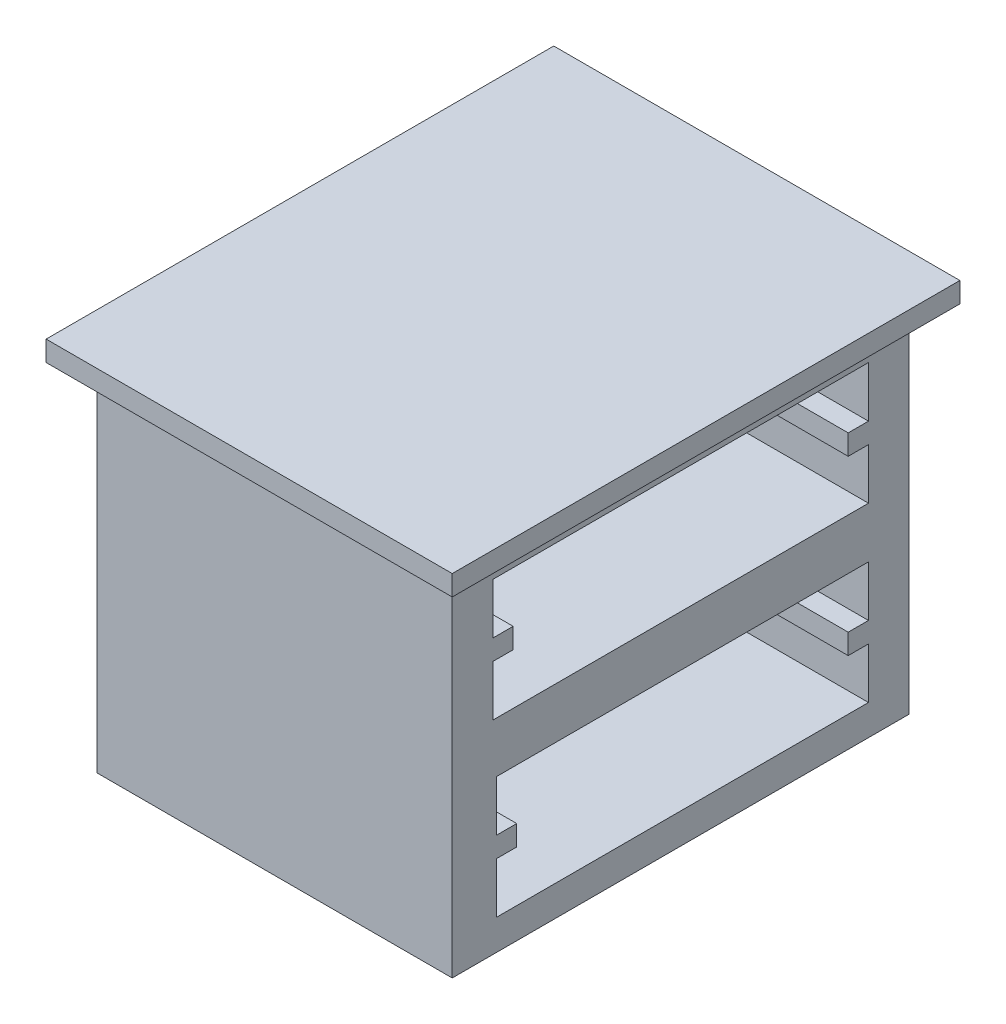
ISO-10303-21;
HEADER;
FILE_DESCRIPTION(('STEP AP214'),'2;1');
FILE_NAME('part.step','',(''),(''),'','','');
FILE_SCHEMA(('AUTOMOTIVE_DESIGN { 1 0 10303 214 1 1 1 1 }'));
ENDSEC;
DATA;
#1=APPLICATION_CONTEXT('core data for automotive mechanical design processes');
#2=APPLICATION_PROTOCOL_DEFINITION('international standard','automotive_design',2000,#1);
#3=PRODUCT_CONTEXT('',#1,'mechanical');
#4=PRODUCT('Part','Part','',(#3));
#5=PRODUCT_RELATED_PRODUCT_CATEGORY('part','',(#4));
#6=PRODUCT_DEFINITION_FORMATION('','',#4);
#7=PRODUCT_DEFINITION_CONTEXT('part definition',#1,'design');
#8=PRODUCT_DEFINITION('design','',#6,#7);
#9=PRODUCT_DEFINITION_SHAPE('','',#8);
#10=(LENGTH_UNIT() NAMED_UNIT(*) SI_UNIT(.MILLI.,.METRE.));
#11=(NAMED_UNIT(*) PLANE_ANGLE_UNIT() SI_UNIT($,.RADIAN.));
#12=(NAMED_UNIT(*) SI_UNIT($,.STERADIAN.) SOLID_ANGLE_UNIT());
#13=UNCERTAINTY_MEASURE_WITH_UNIT(LENGTH_MEASURE(1.E-05),#10,'distance_accuracy_value','');
#14=(GEOMETRIC_REPRESENTATION_CONTEXT(3) GLOBAL_UNCERTAINTY_ASSIGNED_CONTEXT((#13)) GLOBAL_UNIT_ASSIGNED_CONTEXT((#10,
#11,#12)) REPRESENTATION_CONTEXT('',''));
#15=CARTESIAN_POINT('',(0.,0.,0.));
#16=DIRECTION('',(0.,0.,1.));
#17=DIRECTION('',(1.,0.,0.));
#18=AXIS2_PLACEMENT_3D('',#15,#16,#17);
#19=CARTESIAN_POINT('',(0.,-20.,0.));
#20=DIRECTION('',(0.,1.,0.));
#21=DIRECTION('',(0.,0.,1.));
#22=AXIS2_PLACEMENT_3D('',#19,#20,#21);
#23=PLANE('',#22);
#24=DIRECTION('',(0.,0.,1.));
#25=VECTOR('',#24,1.);
#26=CARTESIAN_POINT('',(-200.,-20.,250.));
#27=LINE('',#26,#25);
#28=CARTESIAN_POINT('',(-200.,-20.,-250.));
#29=VERTEX_POINT('',#28);
#30=CARTESIAN_POINT('',(-200.,-20.,250.));
#31=VERTEX_POINT('',#30);
#32=EDGE_CURVE('E477',#29,#31,#27,.T.);
#33=ORIENTED_EDGE('',*,*,#32,.F.);
#34=DIRECTION('',(-1.,0.,0.));
#35=VECTOR('',#34,1.);
#36=CARTESIAN_POINT('',(200.,-20.,-250.));
#37=LINE('',#36,#35);
#38=CARTESIAN_POINT('',(200.,-20.,-250.));
#39=VERTEX_POINT('',#38);
#40=EDGE_CURVE('E487',#39,#29,#37,.T.);
#41=ORIENTED_EDGE('',*,*,#40,.F.);
#42=DIRECTION('',(0.,0.,-1.));
#43=VECTOR('',#42,1.);
#44=CARTESIAN_POINT('',(200.,-20.,250.));
#45=LINE('',#44,#43);
#46=CARTESIAN_POINT('',(200.,-20.,250.));
#47=VERTEX_POINT('',#46);
#48=EDGE_CURVE('E484',#47,#39,#45,.T.);
#49=ORIENTED_EDGE('',*,*,#48,.F.);
#50=DIRECTION('',(1.,0.,0.));
#51=VECTOR('',#50,1.);
#52=CARTESIAN_POINT('',(200.,-20.,250.));
#53=LINE('',#52,#51);
#54=EDGE_CURVE('E480',#31,#47,#53,.T.);
#55=ORIENTED_EDGE('',*,*,#54,.F.);
#56=EDGE_LOOP('',(#33,#41,#49,#55));
#57=FACE_BOUND('',#56,.T.);
#58=DIRECTION('',(0.,0.,-1.));
#59=VECTOR('',#58,1.);
#60=CARTESIAN_POINT('',(-175.,-20.,225.));
#61=LINE('',#60,#59);
#62=CARTESIAN_POINT('',(-175.,-20.,225.));
#63=VERTEX_POINT('',#62);
#64=CARTESIAN_POINT('',(-175.,-20.,-225.));
#65=VERTEX_POINT('',#64);
#66=EDGE_CURVE('E331',#63,#65,#61,.T.);
#67=ORIENTED_EDGE('',*,*,#66,.F.);
#68=DIRECTION('',(-1.,0.,0.));
#69=VECTOR('',#68,1.);
#70=CARTESIAN_POINT('',(175.,-20.,225.));
#71=LINE('',#70,#69);
#72=CARTESIAN_POINT('',(175.,-20.,225.));
#73=VERTEX_POINT('',#72);
#74=EDGE_CURVE('E448',#73,#63,#71,.T.);
#75=ORIENTED_EDGE('',*,*,#74,.F.);
#76=DIRECTION('',(0.,0.,1.));
#77=VECTOR('',#76,1.);
#78=CARTESIAN_POINT('',(175.,-20.,225.));
#79=LINE('',#78,#77);
#80=CARTESIAN_POINT('',(175.,-20.,-225.));
#81=VERTEX_POINT('',#80);
#82=EDGE_CURVE('E460',#81,#73,#79,.T.);
#83=ORIENTED_EDGE('',*,*,#82,.F.);
#84=DIRECTION('',(1.,0.,0.));
#85=VECTOR('',#84,1.);
#86=CARTESIAN_POINT('',(175.,-20.,-225.));
#87=LINE('',#86,#85);
#88=EDGE_CURVE('E457',#65,#81,#87,.T.);
#89=ORIENTED_EDGE('',*,*,#88,.F.);
#90=EDGE_LOOP('',(#67,#75,#83,#89));
#91=FACE_BOUND('',#90,.T.);
#92=ADVANCED_FACE('F37',(#57,#91),#23,.F.);
#93=CARTESIAN_POINT('',(-200.,-20.,250.));
#94=DIRECTION('',(-1.,0.,0.));
#95=DIRECTION('',(0.,0.,1.));
#96=AXIS2_PLACEMENT_3D('',#93,#94,#95);
#97=PLANE('',#96);
#98=DIRECTION('',(0.,0.,1.));
#99=VECTOR('',#98,1.);
#100=CARTESIAN_POINT('',(-200.,0.,250.));
#101=LINE('',#100,#99);
#102=CARTESIAN_POINT('',(-200.,0.,-250.));
#103=VERTEX_POINT('',#102);
#104=CARTESIAN_POINT('',(-200.,0.,250.));
#105=VERTEX_POINT('',#104);
#106=EDGE_CURVE('E476',#103,#105,#101,.T.);
#107=ORIENTED_EDGE('',*,*,#106,.F.);
#108=DIRECTION('',(0.,1.,0.));
#109=VECTOR('',#108,1.);
#110=CARTESIAN_POINT('',(-200.,-20.,-250.));
#111=LINE('',#110,#109);
#112=EDGE_CURVE('E11',#29,#103,#111,.T.);
#113=ORIENTED_EDGE('',*,*,#112,.F.);
#114=ORIENTED_EDGE('',*,*,#32,.T.);
#115=DIRECTION('',(0.,1.,0.));
#116=VECTOR('',#115,1.);
#117=CARTESIAN_POINT('',(-200.,-20.,250.));
#118=LINE('',#117,#116);
#119=EDGE_CURVE('E41',#31,#105,#118,.T.);
#120=ORIENTED_EDGE('',*,*,#119,.T.);
#121=EDGE_LOOP('',(#107,#113,#114,#120));
#122=FACE_BOUND('',#121,.T.);
#123=ADVANCED_FACE('F39',(#122),#97,.T.);
#124=CARTESIAN_POINT('',(200.,-20.,-250.));
#125=DIRECTION('',(0.,0.,-1.));
#126=DIRECTION('',(-1.,0.,0.));
#127=AXIS2_PLACEMENT_3D('',#124,#125,#126);
#128=PLANE('',#127);
#129=DIRECTION('',(-1.,0.,0.));
#130=VECTOR('',#129,1.);
#131=CARTESIAN_POINT('',(200.,0.,-250.));
#132=LINE('',#131,#130);
#133=CARTESIAN_POINT('',(200.,0.,-250.));
#134=VERTEX_POINT('',#133);
#135=EDGE_CURVE('E481',#134,#103,#132,.T.);
#136=ORIENTED_EDGE('',*,*,#135,.F.);
#137=DIRECTION('',(0.,1.,0.));
#138=VECTOR('',#137,1.);
#139=CARTESIAN_POINT('',(200.,-20.,-250.));
#140=LINE('',#139,#138);
#141=EDGE_CURVE('E46',#39,#134,#140,.T.);
#142=ORIENTED_EDGE('',*,*,#141,.F.);
#143=ORIENTED_EDGE('',*,*,#40,.T.);
#144=ORIENTED_EDGE('',*,*,#112,.T.);
#145=EDGE_LOOP('',(#136,#142,#143,#144));
#146=FACE_BOUND('',#145,.T.);
#147=ADVANCED_FACE('F513',(#146),#128,.T.);
#148=CARTESIAN_POINT('',(200.,-20.,250.));
#149=DIRECTION('',(1.,0.,0.));
#150=DIRECTION('',(0.,0.,-1.));
#151=AXIS2_PLACEMENT_3D('',#148,#149,#150);
#152=PLANE('',#151);
#153=DIRECTION('',(0.,0.,-1.));
#154=VECTOR('',#153,1.);
#155=CARTESIAN_POINT('',(200.,0.,250.));
#156=LINE('',#155,#154);
#157=CARTESIAN_POINT('',(200.,0.,250.));
#158=VERTEX_POINT('',#157);
#159=EDGE_CURVE('E495',#158,#134,#156,.T.);
#160=ORIENTED_EDGE('',*,*,#159,.F.);
#161=DIRECTION('',(0.,1.,0.));
#162=VECTOR('',#161,1.);
#163=CARTESIAN_POINT('',(200.,-20.,250.));
#164=LINE('',#163,#162);
#165=EDGE_CURVE('E500',#47,#158,#164,.T.);
#166=ORIENTED_EDGE('',*,*,#165,.F.);
#167=ORIENTED_EDGE('',*,*,#48,.T.);
#168=ORIENTED_EDGE('',*,*,#141,.T.);
#169=EDGE_LOOP('',(#160,#166,#167,#168));
#170=FACE_BOUND('',#169,.T.);
#171=ADVANCED_FACE('F519',(#170),#152,.T.);
#172=CARTESIAN_POINT('',(200.,-20.,250.));
#173=DIRECTION('',(0.,0.,1.));
#174=DIRECTION('',(1.,0.,0.));
#175=AXIS2_PLACEMENT_3D('',#172,#173,#174);
#176=PLANE('',#175);
#177=DIRECTION('',(1.,0.,0.));
#178=VECTOR('',#177,1.);
#179=CARTESIAN_POINT('',(200.,0.,250.));
#180=LINE('',#179,#178);
#181=EDGE_CURVE('E492',#105,#158,#180,.T.);
#182=ORIENTED_EDGE('',*,*,#181,.F.);
#183=ORIENTED_EDGE('',*,*,#119,.F.);
#184=ORIENTED_EDGE('',*,*,#54,.T.);
#185=ORIENTED_EDGE('',*,*,#165,.T.);
#186=EDGE_LOOP('',(#182,#183,#184,#185));
#187=FACE_BOUND('',#186,.T.);
#188=ADVANCED_FACE('F508',(#187),#176,.T.);
#189=CARTESIAN_POINT('',(0.,0.,0.));
#190=DIRECTION('',(0.,1.,0.));
#191=DIRECTION('',(0.,0.,1.));
#192=AXIS2_PLACEMENT_3D('',#189,#190,#191);
#193=PLANE('',#192);
#194=ORIENTED_EDGE('',*,*,#106,.T.);
#195=ORIENTED_EDGE('',*,*,#181,.T.);
#196=ORIENTED_EDGE('',*,*,#159,.T.);
#197=ORIENTED_EDGE('',*,*,#135,.T.);
#198=EDGE_LOOP('',(#194,#195,#196,#197));
#199=FACE_BOUND('',#198,.T.);
#200=ADVANCED_FACE('F510',(#199),#193,.T.);
#201=CARTESIAN_POINT('',(-175.,-370.,225.));
#202=DIRECTION('',(1.,0.,0.));
#203=DIRECTION('',(0.,0.,-1.));
#204=AXIS2_PLACEMENT_3D('',#201,#202,#203);
#205=PLANE('',#204);
#206=ORIENTED_EDGE('',*,*,#66,.T.);
#207=DIRECTION('',(0.,1.,0.));
#208=VECTOR('',#207,1.);
#209=CARTESIAN_POINT('',(-175.,-370.,-225.));
#210=LINE('',#209,#208);
#211=CARTESIAN_POINT('',(-175.,-370.,-225.));
#212=VERTEX_POINT('',#211);
#213=EDGE_CURVE('E473',#212,#65,#210,.T.);
#214=ORIENTED_EDGE('',*,*,#213,.F.);
#215=DIRECTION('',(0.,0.,-1.));
#216=VECTOR('',#215,1.);
#217=CARTESIAN_POINT('',(-175.,-370.,225.));
#218=LINE('',#217,#216);
#219=CARTESIAN_POINT('',(-175.,-370.,225.));
#220=VERTEX_POINT('',#219);
#221=EDGE_CURVE('E444',#220,#212,#218,.T.);
#222=ORIENTED_EDGE('',*,*,#221,.F.);
#223=DIRECTION('',(0.,1.,0.));
#224=VECTOR('',#223,1.);
#225=CARTESIAN_POINT('',(-175.,-370.,225.));
#226=LINE('',#225,#224);
#227=EDGE_CURVE('E454',#220,#63,#226,.T.);
#228=ORIENTED_EDGE('',*,*,#227,.T.);
#229=EDGE_LOOP('',(#206,#214,#222,#228));
#230=FACE_BOUND('',#229,.T.);
#231=ADVANCED_FACE('F534',(#230),#205,.F.);
#232=CARTESIAN_POINT('',(175.,-370.,-225.));
#233=DIRECTION('',(0.,0.,1.));
#234=DIRECTION('',(1.,0.,0.));
#235=AXIS2_PLACEMENT_3D('',#232,#233,#234);
#236=PLANE('',#235);
#237=ORIENTED_EDGE('',*,*,#88,.T.);
#238=DIRECTION('',(0.,1.,0.));
#239=VECTOR('',#238,1.);
#240=CARTESIAN_POINT('',(175.,-370.,-225.));
#241=LINE('',#240,#239);
#242=CARTESIAN_POINT('',(175.,-370.,-225.));
#243=VERTEX_POINT('',#242);
#244=EDGE_CURVE('E470',#243,#81,#241,.T.);
#245=ORIENTED_EDGE('',*,*,#244,.F.);
#246=DIRECTION('',(1.,0.,0.));
#247=VECTOR('',#246,1.);
#248=CARTESIAN_POINT('',(175.,-370.,-225.));
#249=LINE('',#248,#247);
#250=EDGE_CURVE('E447',#212,#243,#249,.T.);
#251=ORIENTED_EDGE('',*,*,#250,.F.);
#252=ORIENTED_EDGE('',*,*,#213,.T.);
#253=EDGE_LOOP('',(#237,#245,#251,#252));
#254=FACE_BOUND('',#253,.T.);
#255=ADVANCED_FACE('F540',(#254),#236,.F.);
#256=CARTESIAN_POINT('',(175.,-370.,225.));
#257=DIRECTION('',(-1.,0.,0.));
#258=DIRECTION('',(0.,0.,1.));
#259=AXIS2_PLACEMENT_3D('',#256,#257,#258);
#260=PLANE('',#259);
#261=DIRECTION('',(0.,0.,-1.));
#262=VECTOR('',#261,1.);
#263=CARTESIAN_POINT('',(175.,-100.,185.));
#264=LINE('',#263,#262);
#265=CARTESIAN_POINT('',(175.,-100.,185.));
#266=VERTEX_POINT('',#265);
#267=CARTESIAN_POINT('',(175.,-100.,165.));
#268=VERTEX_POINT('',#267);
#269=EDGE_CURVE('E300',#266,#268,#264,.T.);
#270=ORIENTED_EDGE('',*,*,#269,.F.);
#271=DIRECTION('',(0.,-1.,0.));
#272=VECTOR('',#271,1.);
#273=CARTESIAN_POINT('',(175.,-50.,185.));
#274=LINE('',#273,#272);
#275=CARTESIAN_POINT('',(175.,-50.,185.));
#276=VERTEX_POINT('',#275);
#277=EDGE_CURVE('E54',#276,#266,#274,.T.);
#278=ORIENTED_EDGE('',*,*,#277,.F.);
#279=DIRECTION('',(0.,0.,1.));
#280=VECTOR('',#279,1.);
#281=CARTESIAN_POINT('',(175.,-50.,185.));
#282=LINE('',#281,#280);
#283=CARTESIAN_POINT('',(175.,-50.,-185.));
#284=VERTEX_POINT('',#283);
#285=EDGE_CURVE('E268',#284,#276,#282,.T.);
#286=ORIENTED_EDGE('',*,*,#285,.F.);
#287=DIRECTION('',(0.,1.,0.));
#288=VECTOR('',#287,1.);
#289=CARTESIAN_POINT('',(175.,-50.,-185.));
#290=LINE('',#289,#288);
#291=CARTESIAN_POINT('',(175.,-100.,-185.));
#292=VERTEX_POINT('',#291);
#293=EDGE_CURVE('E271',#292,#284,#290,.T.);
#294=ORIENTED_EDGE('',*,*,#293,.F.);
#295=DIRECTION('',(0.,0.,-1.));
#296=VECTOR('',#295,1.);
#297=CARTESIAN_POINT('',(175.,-100.,-185.));
#298=LINE('',#297,#296);
#299=CARTESIAN_POINT('',(175.,-100.,-165.));
#300=VERTEX_POINT('',#299);
#301=EDGE_CURVE('E324',#300,#292,#298,.T.);
#302=ORIENTED_EDGE('',*,*,#301,.F.);
#303=DIRECTION('',(0.,1.,0.));
#304=VECTOR('',#303,1.);
#305=CARTESIAN_POINT('',(175.,-100.,-165.));
#306=LINE('',#305,#304);
#307=CARTESIAN_POINT('',(175.,-120.,-165.));
#308=VERTEX_POINT('',#307);
#309=EDGE_CURVE('E321',#308,#300,#306,.T.);
#310=ORIENTED_EDGE('',*,*,#309,.F.);
#311=DIRECTION('',(0.,0.,1.));
#312=VECTOR('',#311,1.);
#313=CARTESIAN_POINT('',(175.,-120.,-185.));
#314=LINE('',#313,#312);
#315=CARTESIAN_POINT('',(175.,-120.,-185.));
#316=VERTEX_POINT('',#315);
#317=EDGE_CURVE('E318',#316,#308,#314,.T.);
#318=ORIENTED_EDGE('',*,*,#317,.F.);
#319=DIRECTION('',(0.,1.,0.));
#320=VECTOR('',#319,1.);
#321=CARTESIAN_POINT('',(175.,-120.,-185.));
#322=LINE('',#321,#320);
#323=CARTESIAN_POINT('',(175.,-170.,-185.));
#324=VERTEX_POINT('',#323);
#325=EDGE_CURVE('E315',#324,#316,#322,.T.);
#326=ORIENTED_EDGE('',*,*,#325,.F.);
#327=DIRECTION('',(0.,0.,-1.));
#328=VECTOR('',#327,1.);
#329=CARTESIAN_POINT('',(175.,-170.,185.));
#330=LINE('',#329,#328);
#331=CARTESIAN_POINT('',(175.,-170.,185.));
#332=VERTEX_POINT('',#331);
#333=EDGE_CURVE('E312',#332,#324,#330,.T.);
#334=ORIENTED_EDGE('',*,*,#333,.F.);
#335=DIRECTION('',(0.,-1.,0.));
#336=VECTOR('',#335,1.);
#337=CARTESIAN_POINT('',(175.,-120.,185.));
#338=LINE('',#337,#336);
#339=CARTESIAN_POINT('',(175.,-120.,185.));
#340=VERTEX_POINT('',#339);
#341=EDGE_CURVE('E309',#340,#332,#338,.T.);
#342=ORIENTED_EDGE('',*,*,#341,.F.);
#343=DIRECTION('',(0.,0.,1.));
#344=VECTOR('',#343,1.);
#345=CARTESIAN_POINT('',(175.,-120.,185.));
#346=LINE('',#345,#344);
#347=CARTESIAN_POINT('',(175.,-120.,165.));
#348=VERTEX_POINT('',#347);
#349=EDGE_CURVE('E306',#348,#340,#346,.T.);
#350=ORIENTED_EDGE('',*,*,#349,.F.);
#351=DIRECTION('',(0.,-1.,0.));
#352=VECTOR('',#351,1.);
#353=CARTESIAN_POINT('',(175.,-100.,165.));
#354=LINE('',#353,#352);
#355=EDGE_CURVE('E303',#268,#348,#354,.T.);
#356=ORIENTED_EDGE('',*,*,#355,.F.);
#357=EDGE_LOOP('',(#270,#278,#286,#294,#302,#310,#318,#326,#334,#342,#350,#356));
#358=FACE_BOUND('',#357,.T.);
#359=DIRECTION('',(0.,0.,-1.));
#360=VECTOR('',#359,1.);
#361=CARTESIAN_POINT('',(175.,-270.,181.478873239436));
#362=LINE('',#361,#360);
#363=CARTESIAN_POINT('',(175.,-270.,181.478873239436));
#364=VERTEX_POINT('',#363);
#365=CARTESIAN_POINT('',(175.,-270.,161.478873239436));
#366=VERTEX_POINT('',#365);
#367=EDGE_CURVE('E390',#364,#366,#362,.T.);
#368=ORIENTED_EDGE('',*,*,#367,.F.);
#369=DIRECTION('',(0.,-1.,0.));
#370=VECTOR('',#369,1.);
#371=CARTESIAN_POINT('',(175.,-220.,181.478873239436));
#372=LINE('',#371,#370);
#373=CARTESIAN_POINT('',(175.,-220.,181.478873239436));
#374=VERTEX_POINT('',#373);
#375=EDGE_CURVE('E62',#374,#364,#372,.T.);
#376=ORIENTED_EDGE('',*,*,#375,.F.);
#377=DIRECTION('',(0.,0.,1.));
#378=VECTOR('',#377,1.);
#379=CARTESIAN_POINT('',(175.,-220.,181.478873239436));
#380=LINE('',#379,#378);
#381=CARTESIAN_POINT('',(175.,-220.,-185.));
#382=VERTEX_POINT('',#381);
#383=EDGE_CURVE('E355',#382,#374,#380,.T.);
#384=ORIENTED_EDGE('',*,*,#383,.F.);
#385=DIRECTION('',(0.,1.,0.));
#386=VECTOR('',#385,1.);
#387=CARTESIAN_POINT('',(175.,-220.,-185.));
#388=LINE('',#387,#386);
#389=CARTESIAN_POINT('',(175.,-270.,-185.));
#390=VERTEX_POINT('',#389);
#391=EDGE_CURVE('E417',#390,#382,#388,.T.);
#392=ORIENTED_EDGE('',*,*,#391,.F.);
#393=DIRECTION('',(0.,0.,-1.));
#394=VECTOR('',#393,1.);
#395=CARTESIAN_POINT('',(175.,-270.,-185.));
#396=LINE('',#395,#394);
#397=CARTESIAN_POINT('',(175.,-270.,-165.));
#398=VERTEX_POINT('',#397);
#399=EDGE_CURVE('E414',#398,#390,#396,.T.);
#400=ORIENTED_EDGE('',*,*,#399,.F.);
#401=DIRECTION('',(0.,1.,0.));
#402=VECTOR('',#401,1.);
#403=CARTESIAN_POINT('',(175.,-270.,-165.));
#404=LINE('',#403,#402);
#405=CARTESIAN_POINT('',(175.,-290.,-165.));
#406=VERTEX_POINT('',#405);
#407=EDGE_CURVE('E411',#406,#398,#404,.T.);
#408=ORIENTED_EDGE('',*,*,#407,.F.);
#409=DIRECTION('',(0.,0.,1.));
#410=VECTOR('',#409,1.);
#411=CARTESIAN_POINT('',(175.,-290.,-185.));
#412=LINE('',#411,#410);
#413=CARTESIAN_POINT('',(175.,-290.,-185.));
#414=VERTEX_POINT('',#413);
#415=EDGE_CURVE('E408',#414,#406,#412,.T.);
#416=ORIENTED_EDGE('',*,*,#415,.F.);
#417=DIRECTION('',(0.,1.,0.));
#418=VECTOR('',#417,1.);
#419=CARTESIAN_POINT('',(175.,-290.,-185.));
#420=LINE('',#419,#418);
#421=CARTESIAN_POINT('',(175.,-340.,-185.));
#422=VERTEX_POINT('',#421);
#423=EDGE_CURVE('E405',#422,#414,#420,.T.);
#424=ORIENTED_EDGE('',*,*,#423,.F.);
#425=DIRECTION('',(0.,0.,-1.));
#426=VECTOR('',#425,1.);
#427=CARTESIAN_POINT('',(175.,-340.,181.478873239436));
#428=LINE('',#427,#426);
#429=CARTESIAN_POINT('',(175.,-340.,181.478873239436));
#430=VERTEX_POINT('',#429);
#431=EDGE_CURVE('E402',#430,#422,#428,.T.);
#432=ORIENTED_EDGE('',*,*,#431,.F.);
#433=DIRECTION('',(0.,-1.,0.));
#434=VECTOR('',#433,1.);
#435=CARTESIAN_POINT('',(175.,-290.,181.478873239436));
#436=LINE('',#435,#434);
#437=CARTESIAN_POINT('',(175.,-290.,181.478873239436));
#438=VERTEX_POINT('',#437);
#439=EDGE_CURVE('E399',#438,#430,#436,.T.);
#440=ORIENTED_EDGE('',*,*,#439,.F.);
#441=DIRECTION('',(0.,0.,1.));
#442=VECTOR('',#441,1.);
#443=CARTESIAN_POINT('',(175.,-290.,181.478873239436));
#444=LINE('',#443,#442);
#445=CARTESIAN_POINT('',(175.,-290.,161.478873239436));
#446=VERTEX_POINT('',#445);
#447=EDGE_CURVE('E396',#446,#438,#444,.T.);
#448=ORIENTED_EDGE('',*,*,#447,.F.);
#449=DIRECTION('',(0.,-1.,0.));
#450=VECTOR('',#449,1.);
#451=CARTESIAN_POINT('',(175.,-270.,161.478873239436));
#452=LINE('',#451,#450);
#453=EDGE_CURVE('E393',#366,#446,#452,.T.);
#454=ORIENTED_EDGE('',*,*,#453,.F.);
#455=EDGE_LOOP('',(#368,#376,#384,#392,#400,#408,#416,#424,#432,#440,#448,#454));
#456=FACE_BOUND('',#455,.T.);
#457=ORIENTED_EDGE('',*,*,#82,.T.);
#458=DIRECTION('',(0.,1.,0.));
#459=VECTOR('',#458,1.);
#460=CARTESIAN_POINT('',(175.,-370.,225.));
#461=LINE('',#460,#459);
#462=CARTESIAN_POINT('',(175.,-370.,225.));
#463=VERTEX_POINT('',#462);
#464=EDGE_CURVE('E467',#463,#73,#461,.T.);
#465=ORIENTED_EDGE('',*,*,#464,.F.);
#466=DIRECTION('',(0.,0.,1.));
#467=VECTOR('',#466,1.);
#468=CARTESIAN_POINT('',(175.,-370.,225.));
#469=LINE('',#468,#467);
#470=EDGE_CURVE('E450',#243,#463,#469,.T.);
#471=ORIENTED_EDGE('',*,*,#470,.F.);
#472=ORIENTED_EDGE('',*,*,#244,.T.);
#473=EDGE_LOOP('',(#457,#465,#471,#472));
#474=FACE_BOUND('',#473,.T.);
#475=ADVANCED_FACE('F545',(#358,#456,#474),#260,.F.);
#476=CARTESIAN_POINT('',(175.,-370.,225.));
#477=DIRECTION('',(0.,0.,-1.));
#478=DIRECTION('',(-1.,0.,0.));
#479=AXIS2_PLACEMENT_3D('',#476,#477,#478);
#480=PLANE('',#479);
#481=ORIENTED_EDGE('',*,*,#74,.T.);
#482=ORIENTED_EDGE('',*,*,#227,.F.);
#483=DIRECTION('',(-1.,0.,0.));
#484=VECTOR('',#483,1.);
#485=CARTESIAN_POINT('',(175.,-370.,225.));
#486=LINE('',#485,#484);
#487=EDGE_CURVE('E452',#463,#220,#486,.T.);
#488=ORIENTED_EDGE('',*,*,#487,.F.);
#489=ORIENTED_EDGE('',*,*,#464,.T.);
#490=EDGE_LOOP('',(#481,#482,#488,#489));
#491=FACE_BOUND('',#490,.T.);
#492=ADVANCED_FACE('F551',(#491),#480,.F.);
#493=CARTESIAN_POINT('',(0.,-370.,0.));
#494=DIRECTION('',(0.,1.,0.));
#495=DIRECTION('',(0.,0.,1.));
#496=AXIS2_PLACEMENT_3D('',#493,#494,#495);
#497=PLANE('',#496);
#498=ORIENTED_EDGE('',*,*,#221,.T.);
#499=ORIENTED_EDGE('',*,*,#250,.T.);
#500=ORIENTED_EDGE('',*,*,#470,.T.);
#501=ORIENTED_EDGE('',*,*,#487,.T.);
#502=EDGE_LOOP('',(#498,#499,#500,#501));
#503=FACE_BOUND('',#502,.T.);
#504=ADVANCED_FACE('F558',(#503),#497,.F.);
#505=CARTESIAN_POINT('',(-145.,-220.,181.478873239436));
#506=DIRECTION('',(0.,0.,1.));
#507=DIRECTION('',(1.,0.,0.));
#508=AXIS2_PLACEMENT_3D('',#505,#506,#507);
#509=PLANE('',#508);
#510=ORIENTED_EDGE('',*,*,#375,.T.);
#511=DIRECTION('',(1.,0.,0.));
#512=VECTOR('',#511,1.);
#513=CARTESIAN_POINT('',(-145.,-270.,181.478873239436));
#514=LINE('',#513,#512);
#515=CARTESIAN_POINT('',(-145.,-270.,181.478873239436));
#516=VERTEX_POINT('',#515);
#517=EDGE_CURVE('E388',#516,#364,#514,.T.);
#518=ORIENTED_EDGE('',*,*,#517,.F.);
#519=DIRECTION('',(0.,-1.,0.));
#520=VECTOR('',#519,1.);
#521=CARTESIAN_POINT('',(-145.,-220.,181.478873239436));
#522=LINE('',#521,#520);
#523=CARTESIAN_POINT('',(-145.,-220.,181.478873239436));
#524=VERTEX_POINT('',#523);
#525=EDGE_CURVE('E351',#524,#516,#522,.T.);
#526=ORIENTED_EDGE('',*,*,#525,.F.);
#527=DIRECTION('',(1.,0.,0.));
#528=VECTOR('',#527,1.);
#529=CARTESIAN_POINT('',(-145.,-220.,181.478873239436));
#530=LINE('',#529,#528);
#531=EDGE_CURVE('E301',#524,#374,#530,.T.);
#532=ORIENTED_EDGE('',*,*,#531,.T.);
#533=EDGE_LOOP('',(#510,#518,#526,#532));
#534=FACE_BOUND('',#533,.T.);
#535=ADVANCED_FACE('F560',(#534),#509,.F.);
#536=CARTESIAN_POINT('',(-145.,-220.,181.478873239436));
#537=DIRECTION('',(0.,1.,0.));
#538=DIRECTION('',(0.,0.,1.));
#539=AXIS2_PLACEMENT_3D('',#536,#537,#538);
#540=PLANE('',#539);
#541=ORIENTED_EDGE('',*,*,#383,.T.);
#542=ORIENTED_EDGE('',*,*,#531,.F.);
#543=DIRECTION('',(0.,0.,1.));
#544=VECTOR('',#543,1.);
#545=CARTESIAN_POINT('',(-145.,-220.,181.478873239436));
#546=LINE('',#545,#544);
#547=CARTESIAN_POINT('',(-145.,-220.,-185.));
#548=VERTEX_POINT('',#547);
#549=EDGE_CURVE('E385',#548,#524,#546,.T.);
#550=ORIENTED_EDGE('',*,*,#549,.F.);
#551=DIRECTION('',(1.,0.,0.));
#552=VECTOR('',#551,1.);
#553=CARTESIAN_POINT('',(-145.,-220.,-185.));
#554=LINE('',#553,#552);
#555=EDGE_CURVE('E423',#548,#382,#554,.T.);
#556=ORIENTED_EDGE('',*,*,#555,.T.);
#557=EDGE_LOOP('',(#541,#542,#550,#556));
#558=FACE_BOUND('',#557,.T.);
#559=ADVANCED_FACE('F566',(#558),#540,.F.);
#560=CARTESIAN_POINT('',(-145.,-220.,-185.));
#561=DIRECTION('',(0.,0.,-1.));
#562=DIRECTION('',(0.,1.,0.));
#563=AXIS2_PLACEMENT_3D('',#560,#561,#562);
#564=PLANE('',#563);
#565=ORIENTED_EDGE('',*,*,#391,.T.);
#566=ORIENTED_EDGE('',*,*,#555,.F.);
#567=DIRECTION('',(0.,1.,0.));
#568=VECTOR('',#567,1.);
#569=CARTESIAN_POINT('',(-145.,-220.,-185.));
#570=LINE('',#569,#568);
#571=CARTESIAN_POINT('',(-145.,-270.,-185.));
#572=VERTEX_POINT('',#571);
#573=EDGE_CURVE('E382',#572,#548,#570,.T.);
#574=ORIENTED_EDGE('',*,*,#573,.F.);
#575=DIRECTION('',(1.,0.,0.));
#576=VECTOR('',#575,1.);
#577=CARTESIAN_POINT('',(-145.,-270.,-185.));
#578=LINE('',#577,#576);
#579=EDGE_CURVE('E425',#572,#390,#578,.T.);
#580=ORIENTED_EDGE('',*,*,#579,.T.);
#581=EDGE_LOOP('',(#565,#566,#574,#580));
#582=FACE_BOUND('',#581,.T.);
#583=ADVANCED_FACE('F595',(#582),#564,.F.);
#584=CARTESIAN_POINT('',(-145.,-270.,-185.));
#585=DIRECTION('',(0.,-1.,0.));
#586=DIRECTION('',(0.,0.,-1.));
#587=AXIS2_PLACEMENT_3D('',#584,#585,#586);
#588=PLANE('',#587);
#589=ORIENTED_EDGE('',*,*,#399,.T.);
#590=ORIENTED_EDGE('',*,*,#579,.F.);
#591=DIRECTION('',(0.,0.,-1.));
#592=VECTOR('',#591,1.);
#593=CARTESIAN_POINT('',(-145.,-270.,-185.));
#594=LINE('',#593,#592);
#595=CARTESIAN_POINT('',(-145.,-270.,-165.));
#596=VERTEX_POINT('',#595);
#597=EDGE_CURVE('E379',#596,#572,#594,.T.);
#598=ORIENTED_EDGE('',*,*,#597,.F.);
#599=DIRECTION('',(1.,0.,0.));
#600=VECTOR('',#599,1.);
#601=CARTESIAN_POINT('',(-145.,-270.,-165.));
#602=LINE('',#601,#600);
#603=EDGE_CURVE('E427',#596,#398,#602,.T.);
#604=ORIENTED_EDGE('',*,*,#603,.T.);
#605=EDGE_LOOP('',(#589,#590,#598,#604));
#606=FACE_BOUND('',#605,.T.);
#607=ADVANCED_FACE('F598',(#606),#588,.F.);
#608=CARTESIAN_POINT('',(-145.,-270.,-165.));
#609=DIRECTION('',(0.,0.,-1.));
#610=DIRECTION('',(-1.,0.,0.));
#611=AXIS2_PLACEMENT_3D('',#608,#609,#610);
#612=PLANE('',#611);
#613=ORIENTED_EDGE('',*,*,#407,.T.);
#614=ORIENTED_EDGE('',*,*,#603,.F.);
#615=DIRECTION('',(0.,1.,0.));
#616=VECTOR('',#615,1.);
#617=CARTESIAN_POINT('',(-145.,-270.,-165.));
#618=LINE('',#617,#616);
#619=CARTESIAN_POINT('',(-145.,-290.,-165.));
#620=VERTEX_POINT('',#619);
#621=EDGE_CURVE('E376',#620,#596,#618,.T.);
#622=ORIENTED_EDGE('',*,*,#621,.F.);
#623=DIRECTION('',(1.,0.,0.));
#624=VECTOR('',#623,1.);
#625=CARTESIAN_POINT('',(-145.,-290.,-165.));
#626=LINE('',#625,#624);
#627=EDGE_CURVE('E429',#620,#406,#626,.T.);
#628=ORIENTED_EDGE('',*,*,#627,.T.);
#629=EDGE_LOOP('',(#613,#614,#622,#628));
#630=FACE_BOUND('',#629,.T.);
#631=ADVANCED_FACE('F601',(#630),#612,.F.);
#632=CARTESIAN_POINT('',(-145.,-290.,-185.));
#633=DIRECTION('',(0.,1.,0.));
#634=DIRECTION('',(0.,0.,1.));
#635=AXIS2_PLACEMENT_3D('',#632,#633,#634);
#636=PLANE('',#635);
#637=ORIENTED_EDGE('',*,*,#415,.T.);
#638=ORIENTED_EDGE('',*,*,#627,.F.);
#639=DIRECTION('',(0.,0.,1.));
#640=VECTOR('',#639,1.);
#641=CARTESIAN_POINT('',(-145.,-290.,-185.));
#642=LINE('',#641,#640);
#643=CARTESIAN_POINT('',(-145.,-290.,-185.));
#644=VERTEX_POINT('',#643);
#645=EDGE_CURVE('E373',#644,#620,#642,.T.);
#646=ORIENTED_EDGE('',*,*,#645,.F.);
#647=DIRECTION('',(1.,0.,0.));
#648=VECTOR('',#647,1.);
#649=CARTESIAN_POINT('',(-145.,-290.,-185.));
#650=LINE('',#649,#648);
#651=EDGE_CURVE('E431',#644,#414,#650,.T.);
#652=ORIENTED_EDGE('',*,*,#651,.T.);
#653=EDGE_LOOP('',(#637,#638,#646,#652));
#654=FACE_BOUND('',#653,.T.);
#655=ADVANCED_FACE('F606',(#654),#636,.F.);
#656=CARTESIAN_POINT('',(-145.,-290.,-185.));
#657=DIRECTION('',(0.,0.,-1.));
#658=DIRECTION('',(-1.,0.,0.));
#659=AXIS2_PLACEMENT_3D('',#656,#657,#658);
#660=PLANE('',#659);
#661=ORIENTED_EDGE('',*,*,#423,.T.);
#662=ORIENTED_EDGE('',*,*,#651,.F.);
#663=DIRECTION('',(0.,1.,0.));
#664=VECTOR('',#663,1.);
#665=CARTESIAN_POINT('',(-145.,-290.,-185.));
#666=LINE('',#665,#664);
#667=CARTESIAN_POINT('',(-145.,-340.,-185.));
#668=VERTEX_POINT('',#667);
#669=EDGE_CURVE('E370',#668,#644,#666,.T.);
#670=ORIENTED_EDGE('',*,*,#669,.F.);
#671=DIRECTION('',(1.,0.,0.));
#672=VECTOR('',#671,1.);
#673=CARTESIAN_POINT('',(-145.,-340.,-185.));
#674=LINE('',#673,#672);
#675=EDGE_CURVE('E433',#668,#422,#674,.T.);
#676=ORIENTED_EDGE('',*,*,#675,.T.);
#677=EDGE_LOOP('',(#661,#662,#670,#676));
#678=FACE_BOUND('',#677,.T.);
#679=ADVANCED_FACE('F610',(#678),#660,.F.);
#680=CARTESIAN_POINT('',(-145.,-340.,181.478873239436));
#681=DIRECTION('',(0.,-1.,0.));
#682=DIRECTION('',(0.,0.,-1.));
#683=AXIS2_PLACEMENT_3D('',#680,#681,#682);
#684=PLANE('',#683);
#685=ORIENTED_EDGE('',*,*,#431,.T.);
#686=ORIENTED_EDGE('',*,*,#675,.F.);
#687=DIRECTION('',(0.,0.,-1.));
#688=VECTOR('',#687,1.);
#689=CARTESIAN_POINT('',(-145.,-340.,181.478873239436));
#690=LINE('',#689,#688);
#691=CARTESIAN_POINT('',(-145.,-340.,181.478873239436));
#692=VERTEX_POINT('',#691);
#693=EDGE_CURVE('E367',#692,#668,#690,.T.);
#694=ORIENTED_EDGE('',*,*,#693,.F.);
#695=DIRECTION('',(1.,0.,0.));
#696=VECTOR('',#695,1.);
#697=CARTESIAN_POINT('',(-145.,-340.,181.478873239436));
#698=LINE('',#697,#696);
#699=EDGE_CURVE('E435',#692,#430,#698,.T.);
#700=ORIENTED_EDGE('',*,*,#699,.T.);
#701=EDGE_LOOP('',(#685,#686,#694,#700));
#702=FACE_BOUND('',#701,.T.);
#703=ADVANCED_FACE('F613',(#702),#684,.F.);
#704=CARTESIAN_POINT('',(-145.,-290.,181.478873239436));
#705=DIRECTION('',(0.,0.,1.));
#706=DIRECTION('',(1.,0.,0.));
#707=AXIS2_PLACEMENT_3D('',#704,#705,#706);
#708=PLANE('',#707);
#709=ORIENTED_EDGE('',*,*,#439,.T.);
#710=ORIENTED_EDGE('',*,*,#699,.F.);
#711=DIRECTION('',(0.,-1.,0.));
#712=VECTOR('',#711,1.);
#713=CARTESIAN_POINT('',(-145.,-290.,181.478873239436));
#714=LINE('',#713,#712);
#715=CARTESIAN_POINT('',(-145.,-290.,181.478873239436));
#716=VERTEX_POINT('',#715);
#717=EDGE_CURVE('E364',#716,#692,#714,.T.);
#718=ORIENTED_EDGE('',*,*,#717,.F.);
#719=DIRECTION('',(1.,0.,0.));
#720=VECTOR('',#719,1.);
#721=CARTESIAN_POINT('',(-145.,-290.,181.478873239436));
#722=LINE('',#721,#720);
#723=EDGE_CURVE('E437',#716,#438,#722,.T.);
#724=ORIENTED_EDGE('',*,*,#723,.T.);
#725=EDGE_LOOP('',(#709,#710,#718,#724));
#726=FACE_BOUND('',#725,.T.);
#727=ADVANCED_FACE('F616',(#726),#708,.F.);
#728=CARTESIAN_POINT('',(-145.,-290.,181.478873239436));
#729=DIRECTION('',(0.,1.,0.));
#730=DIRECTION('',(0.,0.,1.));
#731=AXIS2_PLACEMENT_3D('',#728,#729,#730);
#732=PLANE('',#731);
#733=ORIENTED_EDGE('',*,*,#447,.T.);
#734=ORIENTED_EDGE('',*,*,#723,.F.);
#735=DIRECTION('',(0.,0.,1.));
#736=VECTOR('',#735,1.);
#737=CARTESIAN_POINT('',(-145.,-290.,181.478873239436));
#738=LINE('',#737,#736);
#739=CARTESIAN_POINT('',(-145.,-290.,161.478873239436));
#740=VERTEX_POINT('',#739);
#741=EDGE_CURVE('E361',#740,#716,#738,.T.);
#742=ORIENTED_EDGE('',*,*,#741,.F.);
#743=DIRECTION('',(1.,0.,0.));
#744=VECTOR('',#743,1.);
#745=CARTESIAN_POINT('',(-145.,-290.,161.478873239436));
#746=LINE('',#745,#744);
#747=EDGE_CURVE('E439',#740,#446,#746,.T.);
#748=ORIENTED_EDGE('',*,*,#747,.T.);
#749=EDGE_LOOP('',(#733,#734,#742,#748));
#750=FACE_BOUND('',#749,.T.);
#751=ADVANCED_FACE('F620',(#750),#732,.F.);
#752=CARTESIAN_POINT('',(-145.,-270.,161.478873239436));
#753=DIRECTION('',(0.,0.,1.));
#754=DIRECTION('',(1.,0.,0.));
#755=AXIS2_PLACEMENT_3D('',#752,#753,#754);
#756=PLANE('',#755);
#757=ORIENTED_EDGE('',*,*,#453,.T.);
#758=ORIENTED_EDGE('',*,*,#747,.F.);
#759=DIRECTION('',(0.,-1.,0.));
#760=VECTOR('',#759,1.);
#761=CARTESIAN_POINT('',(-145.,-270.,161.478873239436));
#762=LINE('',#761,#760);
#763=CARTESIAN_POINT('',(-145.,-270.,161.478873239436));
#764=VERTEX_POINT('',#763);
#765=EDGE_CURVE('E358',#764,#740,#762,.T.);
#766=ORIENTED_EDGE('',*,*,#765,.F.);
#767=DIRECTION('',(1.,0.,0.));
#768=VECTOR('',#767,1.);
#769=CARTESIAN_POINT('',(-145.,-270.,161.478873239436));
#770=LINE('',#769,#768);
#771=EDGE_CURVE('E441',#764,#366,#770,.T.);
#772=ORIENTED_EDGE('',*,*,#771,.T.);
#773=EDGE_LOOP('',(#757,#758,#766,#772));
#774=FACE_BOUND('',#773,.T.);
#775=ADVANCED_FACE('F622',(#774),#756,.F.);
#776=CARTESIAN_POINT('',(-145.,-270.,181.478873239436));
#777=DIRECTION('',(0.,-1.,0.));
#778=DIRECTION('',(0.,0.,-1.));
#779=AXIS2_PLACEMENT_3D('',#776,#777,#778);
#780=PLANE('',#779);
#781=ORIENTED_EDGE('',*,*,#367,.T.);
#782=ORIENTED_EDGE('',*,*,#771,.F.);
#783=DIRECTION('',(0.,0.,-1.));
#784=VECTOR('',#783,1.);
#785=CARTESIAN_POINT('',(-145.,-270.,181.478873239436));
#786=LINE('',#785,#784);
#787=EDGE_CURVE('E354',#516,#764,#786,.T.);
#788=ORIENTED_EDGE('',*,*,#787,.F.);
#789=ORIENTED_EDGE('',*,*,#517,.T.);
#790=EDGE_LOOP('',(#781,#782,#788,#789));
#791=FACE_BOUND('',#790,.T.);
#792=ADVANCED_FACE('F582',(#791),#780,.F.);
#793=CARTESIAN_POINT('',(-145.,0.,0.));
#794=DIRECTION('',(1.,0.,0.));
#795=DIRECTION('',(0.,0.,-1.));
#796=AXIS2_PLACEMENT_3D('',#793,#794,#795);
#797=PLANE('',#796);
#798=ORIENTED_EDGE('',*,*,#525,.T.);
#799=ORIENTED_EDGE('',*,*,#787,.T.);
#800=ORIENTED_EDGE('',*,*,#765,.T.);
#801=ORIENTED_EDGE('',*,*,#741,.T.);
#802=ORIENTED_EDGE('',*,*,#717,.T.);
#803=ORIENTED_EDGE('',*,*,#693,.T.);
#804=ORIENTED_EDGE('',*,*,#669,.T.);
#805=ORIENTED_EDGE('',*,*,#645,.T.);
#806=ORIENTED_EDGE('',*,*,#621,.T.);
#807=ORIENTED_EDGE('',*,*,#597,.T.);
#808=ORIENTED_EDGE('',*,*,#573,.T.);
#809=ORIENTED_EDGE('',*,*,#549,.T.);
#810=EDGE_LOOP('',(#798,#799,#800,#801,#802,#803,#804,#805,#806,#807,#808,#809));
#811=FACE_BOUND('',#810,.T.);
#812=ADVANCED_FACE('F588',(#811),#797,.T.);
#813=CARTESIAN_POINT('',(-145.,-50.,185.));
#814=DIRECTION('',(0.,0.,1.));
#815=DIRECTION('',(1.,0.,0.));
#816=AXIS2_PLACEMENT_3D('',#813,#814,#815);
#817=PLANE('',#816);
#818=ORIENTED_EDGE('',*,*,#277,.T.);
#819=DIRECTION('',(1.,0.,0.));
#820=VECTOR('',#819,1.);
#821=CARTESIAN_POINT('',(-145.,-100.,185.));
#822=LINE('',#821,#820);
#823=CARTESIAN_POINT('',(-145.,-100.,185.));
#824=VERTEX_POINT('',#823);
#825=EDGE_CURVE('E245',#824,#266,#822,.T.);
#826=ORIENTED_EDGE('',*,*,#825,.F.);
#827=DIRECTION('',(0.,-1.,0.));
#828=VECTOR('',#827,1.);
#829=CARTESIAN_POINT('',(-145.,-50.,185.));
#830=LINE('',#829,#828);
#831=CARTESIAN_POINT('',(-145.,-50.,185.));
#832=VERTEX_POINT('',#831);
#833=EDGE_CURVE('E249',#832,#824,#830,.T.);
#834=ORIENTED_EDGE('',*,*,#833,.F.);
#835=DIRECTION('',(1.,0.,0.));
#836=VECTOR('',#835,1.);
#837=CARTESIAN_POINT('',(-145.,-50.,185.));
#838=LINE('',#837,#836);
#839=EDGE_CURVE('E329',#832,#276,#838,.T.);
#840=ORIENTED_EDGE('',*,*,#839,.T.);
#841=EDGE_LOOP('',(#818,#826,#834,#840));
#842=FACE_BOUND('',#841,.T.);
#843=ADVANCED_FACE('F247',(#842),#817,.F.);
#844=CARTESIAN_POINT('',(-145.,-50.,185.));
#845=DIRECTION('',(0.,1.,0.));
#846=DIRECTION('',(0.,0.,1.));
#847=AXIS2_PLACEMENT_3D('',#844,#845,#846);
#848=PLANE('',#847);
#849=ORIENTED_EDGE('',*,*,#285,.T.);
#850=ORIENTED_EDGE('',*,*,#839,.F.);
#851=DIRECTION('',(0.,0.,1.));
#852=VECTOR('',#851,1.);
#853=CARTESIAN_POINT('',(-145.,-50.,185.));
#854=LINE('',#853,#852);
#855=CARTESIAN_POINT('',(-145.,-50.,-185.));
#856=VERTEX_POINT('',#855);
#857=EDGE_CURVE('E255',#856,#832,#854,.T.);
#858=ORIENTED_EDGE('',*,*,#857,.F.);
#859=DIRECTION('',(1.,0.,0.));
#860=VECTOR('',#859,1.);
#861=CARTESIAN_POINT('',(-145.,-50.,-185.));
#862=LINE('',#861,#860);
#863=EDGE_CURVE('E332',#856,#284,#862,.T.);
#864=ORIENTED_EDGE('',*,*,#863,.T.);
#865=EDGE_LOOP('',(#849,#850,#858,#864));
#866=FACE_BOUND('',#865,.T.);
#867=ADVANCED_FACE('F651',(#866),#848,.F.);
#868=CARTESIAN_POINT('',(-145.,-50.,-185.));
#869=DIRECTION('',(0.,0.,-1.));
#870=DIRECTION('',(0.,1.,0.));
#871=AXIS2_PLACEMENT_3D('',#868,#869,#870);
#872=PLANE('',#871);
#873=ORIENTED_EDGE('',*,*,#293,.T.);
#874=ORIENTED_EDGE('',*,*,#863,.F.);
#875=DIRECTION('',(0.,1.,0.));
#876=VECTOR('',#875,1.);
#877=CARTESIAN_POINT('',(-145.,-50.,-185.));
#878=LINE('',#877,#876);
#879=CARTESIAN_POINT('',(-145.,-100.,-185.));
#880=VERTEX_POINT('',#879);
#881=EDGE_CURVE('E296',#880,#856,#878,.T.);
#882=ORIENTED_EDGE('',*,*,#881,.F.);
#883=DIRECTION('',(1.,0.,0.));
#884=VECTOR('',#883,1.);
#885=CARTESIAN_POINT('',(-145.,-100.,-185.));
#886=LINE('',#885,#884);
#887=EDGE_CURVE('E334',#880,#292,#886,.T.);
#888=ORIENTED_EDGE('',*,*,#887,.T.);
#889=EDGE_LOOP('',(#873,#874,#882,#888));
#890=FACE_BOUND('',#889,.T.);
#891=ADVANCED_FACE('F685',(#890),#872,.F.);
#892=CARTESIAN_POINT('',(-145.,-100.,-185.));
#893=DIRECTION('',(0.,-1.,0.));
#894=DIRECTION('',(0.,0.,-1.));
#895=AXIS2_PLACEMENT_3D('',#892,#893,#894);
#896=PLANE('',#895);
#897=ORIENTED_EDGE('',*,*,#301,.T.);
#898=ORIENTED_EDGE('',*,*,#887,.F.);
#899=DIRECTION('',(0.,0.,-1.));
#900=VECTOR('',#899,1.);
#901=CARTESIAN_POINT('',(-145.,-100.,-185.));
#902=LINE('',#901,#900);
#903=CARTESIAN_POINT('',(-145.,-100.,-165.));
#904=VERTEX_POINT('',#903);
#905=EDGE_CURVE('E293',#904,#880,#902,.T.);
#906=ORIENTED_EDGE('',*,*,#905,.F.);
#907=DIRECTION('',(1.,0.,0.));
#908=VECTOR('',#907,1.);
#909=CARTESIAN_POINT('',(-145.,-100.,-165.));
#910=LINE('',#909,#908);
#911=EDGE_CURVE('E336',#904,#300,#910,.T.);
#912=ORIENTED_EDGE('',*,*,#911,.T.);
#913=EDGE_LOOP('',(#897,#898,#906,#912));
#914=FACE_BOUND('',#913,.T.);
#915=ADVANCED_FACE('F681',(#914),#896,.F.);
#916=CARTESIAN_POINT('',(-145.,-100.,-165.));
#917=DIRECTION('',(0.,0.,-1.));
#918=DIRECTION('',(-1.,0.,0.));
#919=AXIS2_PLACEMENT_3D('',#916,#917,#918);
#920=PLANE('',#919);
#921=ORIENTED_EDGE('',*,*,#309,.T.);
#922=ORIENTED_EDGE('',*,*,#911,.F.);
#923=DIRECTION('',(0.,1.,0.));
#924=VECTOR('',#923,1.);
#925=CARTESIAN_POINT('',(-145.,-100.,-165.));
#926=LINE('',#925,#924);
#927=CARTESIAN_POINT('',(-145.,-120.,-165.));
#928=VERTEX_POINT('',#927);
#929=EDGE_CURVE('E290',#928,#904,#926,.T.);
#930=ORIENTED_EDGE('',*,*,#929,.F.);
#931=DIRECTION('',(1.,0.,0.));
#932=VECTOR('',#931,1.);
#933=CARTESIAN_POINT('',(-145.,-120.,-165.));
#934=LINE('',#933,#932);
#935=EDGE_CURVE('E338',#928,#308,#934,.T.);
#936=ORIENTED_EDGE('',*,*,#935,.T.);
#937=EDGE_LOOP('',(#921,#922,#930,#936));
#938=FACE_BOUND('',#937,.T.);
#939=ADVANCED_FACE('F677',(#938),#920,.F.);
#940=CARTESIAN_POINT('',(-145.,-120.,-185.));
#941=DIRECTION('',(0.,1.,0.));
#942=DIRECTION('',(0.,0.,1.));
#943=AXIS2_PLACEMENT_3D('',#940,#941,#942);
#944=PLANE('',#943);
#945=ORIENTED_EDGE('',*,*,#317,.T.);
#946=ORIENTED_EDGE('',*,*,#935,.F.);
#947=DIRECTION('',(0.,0.,1.));
#948=VECTOR('',#947,1.);
#949=CARTESIAN_POINT('',(-145.,-120.,-185.));
#950=LINE('',#949,#948);
#951=CARTESIAN_POINT('',(-145.,-120.,-185.));
#952=VERTEX_POINT('',#951);
#953=EDGE_CURVE('E287',#952,#928,#950,.T.);
#954=ORIENTED_EDGE('',*,*,#953,.F.);
#955=DIRECTION('',(1.,0.,0.));
#956=VECTOR('',#955,1.);
#957=CARTESIAN_POINT('',(-145.,-120.,-185.));
#958=LINE('',#957,#956);
#959=EDGE_CURVE('E340',#952,#316,#958,.T.);
#960=ORIENTED_EDGE('',*,*,#959,.T.);
#961=EDGE_LOOP('',(#945,#946,#954,#960));
#962=FACE_BOUND('',#961,.T.);
#963=ADVANCED_FACE('F673',(#962),#944,.F.);
#964=CARTESIAN_POINT('',(-145.,-120.,-185.));
#965=DIRECTION('',(0.,0.,-1.));
#966=DIRECTION('',(-1.,0.,0.));
#967=AXIS2_PLACEMENT_3D('',#964,#965,#966);
#968=PLANE('',#967);
#969=ORIENTED_EDGE('',*,*,#325,.T.);
#970=ORIENTED_EDGE('',*,*,#959,.F.);
#971=DIRECTION('',(0.,1.,0.));
#972=VECTOR('',#971,1.);
#973=CARTESIAN_POINT('',(-145.,-120.,-185.));
#974=LINE('',#973,#972);
#975=CARTESIAN_POINT('',(-145.,-170.,-185.));
#976=VERTEX_POINT('',#975);
#977=EDGE_CURVE('E284',#976,#952,#974,.T.);
#978=ORIENTED_EDGE('',*,*,#977,.F.);
#979=DIRECTION('',(1.,0.,0.));
#980=VECTOR('',#979,1.);
#981=CARTESIAN_POINT('',(-145.,-170.,-185.));
#982=LINE('',#981,#980);
#983=EDGE_CURVE('E342',#976,#324,#982,.T.);
#984=ORIENTED_EDGE('',*,*,#983,.T.);
#985=EDGE_LOOP('',(#969,#970,#978,#984));
#986=FACE_BOUND('',#985,.T.);
#987=ADVANCED_FACE('F669',(#986),#968,.F.);
#988=CARTESIAN_POINT('',(-145.,-170.,185.));
#989=DIRECTION('',(0.,-1.,0.));
#990=DIRECTION('',(0.,0.,-1.));
#991=AXIS2_PLACEMENT_3D('',#988,#989,#990);
#992=PLANE('',#991);
#993=ORIENTED_EDGE('',*,*,#333,.T.);
#994=ORIENTED_EDGE('',*,*,#983,.F.);
#995=DIRECTION('',(0.,0.,-1.));
#996=VECTOR('',#995,1.);
#997=CARTESIAN_POINT('',(-145.,-170.,185.));
#998=LINE('',#997,#996);
#999=CARTESIAN_POINT('',(-145.,-170.,185.));
#1000=VERTEX_POINT('',#999);
#1001=EDGE_CURVE('E281',#1000,#976,#998,.T.);
#1002=ORIENTED_EDGE('',*,*,#1001,.F.);
#1003=DIRECTION('',(1.,0.,0.));
#1004=VECTOR('',#1003,1.);
#1005=CARTESIAN_POINT('',(-145.,-170.,185.));
#1006=LINE('',#1005,#1004);
#1007=EDGE_CURVE('E344',#1000,#332,#1006,.T.);
#1008=ORIENTED_EDGE('',*,*,#1007,.T.);
#1009=EDGE_LOOP('',(#993,#994,#1002,#1008));
#1010=FACE_BOUND('',#1009,.T.);
#1011=ADVANCED_FACE('F665',(#1010),#992,.F.);
#1012=CARTESIAN_POINT('',(-145.,-120.,185.));
#1013=DIRECTION('',(0.,0.,1.));
#1014=DIRECTION('',(0.,-1.,0.));
#1015=AXIS2_PLACEMENT_3D('',#1012,#1013,#1014);
#1016=PLANE('',#1015);
#1017=ORIENTED_EDGE('',*,*,#341,.T.);
#1018=ORIENTED_EDGE('',*,*,#1007,.F.);
#1019=DIRECTION('',(0.,-1.,0.));
#1020=VECTOR('',#1019,1.);
#1021=CARTESIAN_POINT('',(-145.,-120.,185.));
#1022=LINE('',#1021,#1020);
#1023=CARTESIAN_POINT('',(-145.,-120.,185.));
#1024=VERTEX_POINT('',#1023);
#1025=EDGE_CURVE('E278',#1024,#1000,#1022,.T.);
#1026=ORIENTED_EDGE('',*,*,#1025,.F.);
#1027=DIRECTION('',(1.,0.,0.));
#1028=VECTOR('',#1027,1.);
#1029=CARTESIAN_POINT('',(-145.,-120.,185.));
#1030=LINE('',#1029,#1028);
#1031=EDGE_CURVE('E346',#1024,#340,#1030,.T.);
#1032=ORIENTED_EDGE('',*,*,#1031,.T.);
#1033=EDGE_LOOP('',(#1017,#1018,#1026,#1032));
#1034=FACE_BOUND('',#1033,.T.);
#1035=ADVANCED_FACE('F661',(#1034),#1016,.F.);
#1036=CARTESIAN_POINT('',(-145.,-120.,185.));
#1037=DIRECTION('',(0.,1.,0.));
#1038=DIRECTION('',(0.,0.,1.));
#1039=AXIS2_PLACEMENT_3D('',#1036,#1037,#1038);
#1040=PLANE('',#1039);
#1041=ORIENTED_EDGE('',*,*,#349,.T.);
#1042=ORIENTED_EDGE('',*,*,#1031,.F.);
#1043=DIRECTION('',(0.,0.,1.));
#1044=VECTOR('',#1043,1.);
#1045=CARTESIAN_POINT('',(-145.,-120.,185.));
#1046=LINE('',#1045,#1044);
#1047=CARTESIAN_POINT('',(-145.,-120.,165.));
#1048=VERTEX_POINT('',#1047);
#1049=EDGE_CURVE('E275',#1048,#1024,#1046,.T.);
#1050=ORIENTED_EDGE('',*,*,#1049,.F.);
#1051=DIRECTION('',(1.,0.,0.));
#1052=VECTOR('',#1051,1.);
#1053=CARTESIAN_POINT('',(-145.,-120.,165.));
#1054=LINE('',#1053,#1052);
#1055=EDGE_CURVE('E348',#1048,#348,#1054,.T.);
#1056=ORIENTED_EDGE('',*,*,#1055,.T.);
#1057=EDGE_LOOP('',(#1041,#1042,#1050,#1056));
#1058=FACE_BOUND('',#1057,.T.);
#1059=ADVANCED_FACE('F657',(#1058),#1040,.F.);
#1060=CARTESIAN_POINT('',(-145.,-100.,165.));
#1061=DIRECTION('',(0.,0.,1.));
#1062=DIRECTION('',(0.,-1.,0.));
#1063=AXIS2_PLACEMENT_3D('',#1060,#1061,#1062);
#1064=PLANE('',#1063);
#1065=ORIENTED_EDGE('',*,*,#355,.T.);
#1066=ORIENTED_EDGE('',*,*,#1055,.F.);
#1067=DIRECTION('',(0.,-1.,0.));
#1068=VECTOR('',#1067,1.);
#1069=CARTESIAN_POINT('',(-145.,-100.,165.));
#1070=LINE('',#1069,#1068);
#1071=CARTESIAN_POINT('',(-145.,-100.,165.));
#1072=VERTEX_POINT('',#1071);
#1073=EDGE_CURVE('E263',#1072,#1048,#1070,.T.);
#1074=ORIENTED_EDGE('',*,*,#1073,.F.);
#1075=DIRECTION('',(1.,0.,0.));
#1076=VECTOR('',#1075,1.);
#1077=CARTESIAN_POINT('',(-145.,-100.,165.));
#1078=LINE('',#1077,#1076);
#1079=EDGE_CURVE('E254',#1072,#268,#1078,.T.);
#1080=ORIENTED_EDGE('',*,*,#1079,.T.);
#1081=EDGE_LOOP('',(#1065,#1066,#1074,#1080));
#1082=FACE_BOUND('',#1081,.T.);
#1083=ADVANCED_FACE('F654',(#1082),#1064,.F.);
#1084=CARTESIAN_POINT('',(-145.,-100.,185.));
#1085=DIRECTION('',(0.,-1.,0.));
#1086=DIRECTION('',(0.,0.,-1.));
#1087=AXIS2_PLACEMENT_3D('',#1084,#1085,#1086);
#1088=PLANE('',#1087);
#1089=ORIENTED_EDGE('',*,*,#269,.T.);
#1090=ORIENTED_EDGE('',*,*,#1079,.F.);
#1091=DIRECTION('',(0.,0.,-1.));
#1092=VECTOR('',#1091,1.);
#1093=CARTESIAN_POINT('',(-145.,-100.,185.));
#1094=LINE('',#1093,#1092);
#1095=EDGE_CURVE('E258',#824,#1072,#1094,.T.);
#1096=ORIENTED_EDGE('',*,*,#1095,.F.);
#1097=ORIENTED_EDGE('',*,*,#825,.T.);
#1098=EDGE_LOOP('',(#1089,#1090,#1096,#1097));
#1099=FACE_BOUND('',#1098,.T.);
#1100=ADVANCED_FACE('F259',(#1099),#1088,.F.);
#1101=CARTESIAN_POINT('',(-145.,0.,0.));
#1102=DIRECTION('',(1.,0.,0.));
#1103=DIRECTION('',(0.,0.,-1.));
#1104=AXIS2_PLACEMENT_3D('',#1101,#1102,#1103);
#1105=PLANE('',#1104);
#1106=ORIENTED_EDGE('',*,*,#833,.T.);
#1107=ORIENTED_EDGE('',*,*,#1095,.T.);
#1108=ORIENTED_EDGE('',*,*,#1073,.T.);
#1109=ORIENTED_EDGE('',*,*,#1049,.T.);
#1110=ORIENTED_EDGE('',*,*,#1025,.T.);
#1111=ORIENTED_EDGE('',*,*,#1001,.T.);
#1112=ORIENTED_EDGE('',*,*,#977,.T.);
#1113=ORIENTED_EDGE('',*,*,#953,.T.);
#1114=ORIENTED_EDGE('',*,*,#929,.T.);
#1115=ORIENTED_EDGE('',*,*,#905,.T.);
#1116=ORIENTED_EDGE('',*,*,#881,.T.);
#1117=ORIENTED_EDGE('',*,*,#857,.T.);
#1118=EDGE_LOOP('',(#1106,#1107,#1108,#1109,#1110,#1111,#1112,#1113,#1114,#1115,#1116,#1117));
#1119=FACE_BOUND('',#1118,.T.);
#1120=ADVANCED_FACE('F265',(#1119),#1105,.T.);
#1121=CLOSED_SHELL('',(#92,#123,#147,#171,#188,#200,#231,#255,#475,#492,#504,#535,#559,#583,
#607,#631,#655,#679,#703,#727,#751,#775,#792,#812,#843,#867,#891,#915,#939,#963,#987,#1011,
#1035,#1059,#1083,#1100,#1120));
#1122=MANIFOLD_SOLID_BREP('B2',#1121);
#1123=ADVANCED_BREP_SHAPE_REPRESENTATION('',(#18,#1122),#14);
#1124=SHAPE_DEFINITION_REPRESENTATION(#9,#1123);
ENDSEC;
END-ISO-10303-21;
